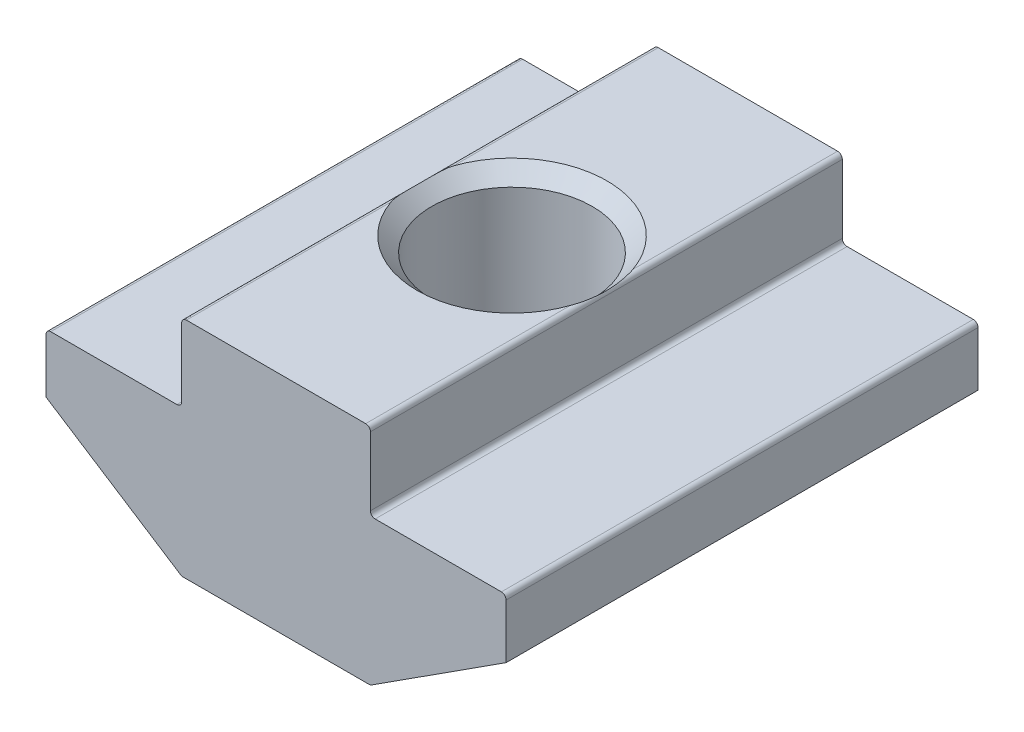
ISO-10303-21;
HEADER;
FILE_DESCRIPTION(('STEP AP214'),'2;1');
FILE_NAME('part.step','',(''),(''),'','','');
FILE_SCHEMA(('AUTOMOTIVE_DESIGN { 1 0 10303 214 1 1 1 1 }'));
ENDSEC;
DATA;
#1=APPLICATION_CONTEXT('core data for automotive mechanical design processes');
#2=APPLICATION_PROTOCOL_DEFINITION('international standard','automotive_design',2000,#1);
#3=PRODUCT_CONTEXT('',#1,'mechanical');
#4=PRODUCT('Part','Part','',(#3));
#5=PRODUCT_RELATED_PRODUCT_CATEGORY('part','',(#4));
#6=PRODUCT_DEFINITION_FORMATION('','',#4);
#7=PRODUCT_DEFINITION_CONTEXT('part definition',#1,'design');
#8=PRODUCT_DEFINITION('design','',#6,#7);
#9=PRODUCT_DEFINITION_SHAPE('','',#8);
#10=(LENGTH_UNIT() NAMED_UNIT(*) SI_UNIT(.MILLI.,.METRE.));
#11=(NAMED_UNIT(*) PLANE_ANGLE_UNIT() SI_UNIT($,.RADIAN.));
#12=(NAMED_UNIT(*) SI_UNIT($,.STERADIAN.) SOLID_ANGLE_UNIT());
#13=UNCERTAINTY_MEASURE_WITH_UNIT(LENGTH_MEASURE(1.E-05),#10,'distance_accuracy_value','');
#14=(GEOMETRIC_REPRESENTATION_CONTEXT(3) GLOBAL_UNCERTAINTY_ASSIGNED_CONTEXT((#13)) GLOBAL_UNIT_ASSIGNED_CONTEXT((#10,
#11,#12)) REPRESENTATION_CONTEXT('',''));
#15=CARTESIAN_POINT('',(0.,0.,0.));
#16=DIRECTION('',(0.,0.,1.));
#17=DIRECTION('',(1.,0.,0.));
#18=AXIS2_PLACEMENT_3D('',#15,#16,#17);
#19=CARTESIAN_POINT('',(-4.,-9.5,10.));
#20=DIRECTION('',(0.,1.,0.));
#21=DIRECTION('',(0.,0.,1.));
#22=AXIS2_PLACEMENT_3D('',#19,#20,#21);
#23=PLANE('',#22);
#24=DIRECTION('',(1.,0.,0.));
#25=VECTOR('',#24,1.);
#26=CARTESIAN_POINT('',(-4.,-9.5,-10.));
#27=LINE('',#26,#25);
#28=CARTESIAN_POINT('',(-3.94121189290537,-9.5,-10.));
#29=VERTEX_POINT('',#28);
#30=CARTESIAN_POINT('',(3.94121189290537,-9.5,-10.));
#31=VERTEX_POINT('',#30);
#32=EDGE_CURVE('E244',#29,#31,#27,.T.);
#33=ORIENTED_EDGE('',*,*,#32,.T.);
#34=DIRECTION('',(0.,0.,-1.));
#35=VECTOR('',#34,1.);
#36=CARTESIAN_POINT('',(3.94121189290537,-9.5,-5.40849535346846));
#37=LINE('',#36,#35);
#38=CARTESIAN_POINT('',(3.94121189290537,-9.5,-0.816990706936917));
#39=VERTEX_POINT('',#38);
#40=EDGE_CURVE('E285',#31,#39,#37,.F.);
#41=ORIENTED_EDGE('',*,*,#40,.T.);
#42=CARTESIAN_POINT('',(0.,-9.5,0.));
#43=DIRECTION('',(0.,1.,0.));
#44=DIRECTION('',(0.,0.,1.));
#45=AXIS2_PLACEMENT_3D('',#42,#43,#44);
#46=CIRCLE('',#45,4.025);
#47=CARTESIAN_POINT('',(-3.94121189290537,-9.5,-0.816990706936917));
#48=VERTEX_POINT('',#47);
#49=EDGE_CURVE('E266',#39,#48,#46,.T.);
#50=ORIENTED_EDGE('',*,*,#49,.T.);
#51=DIRECTION('',(0.,0.,-1.));
#52=VECTOR('',#51,1.);
#53=CARTESIAN_POINT('',(-3.94121189290537,-9.5,-5.40849535346846));
#54=LINE('',#53,#52);
#55=EDGE_CURVE('E283',#48,#29,#54,.T.);
#56=ORIENTED_EDGE('',*,*,#55,.T.);
#57=EDGE_LOOP('',(#33,#41,#50,#56));
#58=FACE_BOUND('',#57,.T.);
#59=ADVANCED_FACE('F37',(#58),#23,.F.);
#60=CARTESIAN_POINT('',(4.,0.,10.));
#61=DIRECTION('',(0.,-1.,0.));
#62=DIRECTION('',(1.,0.,0.));
#63=AXIS2_PLACEMENT_3D('',#60,#61,#62);
#64=PLANE('',#63);
#65=CARTESIAN_POINT('',(0.,0.,0.));
#66=DIRECTION('',(0.,1.,0.));
#67=DIRECTION('',(0.,0.,1.));
#68=AXIS2_PLACEMENT_3D('',#65,#66,#67);
#69=CIRCLE('',#68,4.025);
#70=CARTESIAN_POINT('',(3.8,0.,-1.32688545097156));
#71=VERTEX_POINT('',#70);
#72=CARTESIAN_POINT('',(-3.8,0.,-1.32688545097156));
#73=VERTEX_POINT('',#72);
#74=EDGE_CURVE('E267',#71,#73,#69,.T.);
#75=ORIENTED_EDGE('',*,*,#74,.F.);
#76=DIRECTION('',(0.,0.,-1.));
#77=VECTOR('',#76,1.);
#78=CARTESIAN_POINT('',(3.8,0.,-5.66344272548578));
#79=LINE('',#78,#77);
#80=CARTESIAN_POINT('',(3.8,0.,-10.));
#81=VERTEX_POINT('',#80);
#82=EDGE_CURVE('E482',#71,#81,#79,.T.);
#83=ORIENTED_EDGE('',*,*,#82,.T.);
#84=DIRECTION('',(-1.,0.,0.));
#85=VECTOR('',#84,1.);
#86=CARTESIAN_POINT('',(4.,0.,-10.));
#87=LINE('',#86,#85);
#88=CARTESIAN_POINT('',(-3.8,0.,-10.));
#89=VERTEX_POINT('',#88);
#90=EDGE_CURVE('E258',#81,#89,#87,.T.);
#91=ORIENTED_EDGE('',*,*,#90,.T.);
#92=DIRECTION('',(0.,0.,-1.));
#93=VECTOR('',#92,1.);
#94=CARTESIAN_POINT('',(-3.8,0.,-5.66344272548578));
#95=LINE('',#94,#93);
#96=EDGE_CURVE('E52',#89,#73,#95,.F.);
#97=ORIENTED_EDGE('',*,*,#96,.T.);
#98=EDGE_LOOP('',(#75,#83,#91,#97));
#99=FACE_BOUND('',#98,.T.);
#100=ADVANCED_FACE('F322',(#99),#64,.F.);
#101=DIRECTION('',(-1.,0.,0.));
#102=VECTOR('',#101,1.);
#103=CARTESIAN_POINT('',(4.,0.,10.));
#104=LINE('',#103,#102);
#105=CARTESIAN_POINT('',(3.8,0.,10.));
#106=VERTEX_POINT('',#105);
#107=CARTESIAN_POINT('',(-3.8,0.,10.));
#108=VERTEX_POINT('',#107);
#109=EDGE_CURVE('E231',#106,#108,#104,.T.);
#110=ORIENTED_EDGE('',*,*,#109,.F.);
#111=DIRECTION('',(0.,0.,-1.));
#112=VECTOR('',#111,1.);
#113=CARTESIAN_POINT('',(3.8,0.,10.));
#114=LINE('',#113,#112);
#115=CARTESIAN_POINT('',(3.8,0.,1.32688545097156));
#116=VERTEX_POINT('',#115);
#117=EDGE_CURVE('E416',#106,#116,#114,.T.);
#118=ORIENTED_EDGE('',*,*,#117,.T.);
#119=CARTESIAN_POINT('',(-3.8,0.,1.32688545097156));
#120=VERTEX_POINT('',#119);
#121=EDGE_CURVE('E209',#120,#116,#69,.T.);
#122=ORIENTED_EDGE('',*,*,#121,.F.);
#123=DIRECTION('',(0.,0.,-1.));
#124=VECTOR('',#123,1.);
#125=CARTESIAN_POINT('',(-3.8,0.,10.));
#126=LINE('',#125,#124);
#127=EDGE_CURVE('E414',#120,#108,#126,.F.);
#128=ORIENTED_EDGE('',*,*,#127,.T.);
#129=EDGE_LOOP('',(#110,#118,#122,#128));
#130=FACE_BOUND('',#129,.T.);
#131=ADVANCED_FACE('F325',(#130),#64,.F.);
#132=CARTESIAN_POINT('',(-4.,0.,10.));
#133=DIRECTION('',(1.,0.,0.));
#134=DIRECTION('',(0.,0.,-1.));
#135=AXIS2_PLACEMENT_3D('',#132,#133,#134);
#136=PLANE('',#135);
#137=DIRECTION('',(0.,-1.,0.));
#138=VECTOR('',#137,1.);
#139=CARTESIAN_POINT('',(-4.,0.,10.));
#140=LINE('',#139,#138);
#141=CARTESIAN_POINT('',(-4.,-0.200000000000002,10.));
#142=VERTEX_POINT('',#141);
#143=CARTESIAN_POINT('',(-4.,-3.1,10.));
#144=VERTEX_POINT('',#143);
#145=EDGE_CURVE('E260',#142,#144,#140,.T.);
#146=ORIENTED_EDGE('',*,*,#145,.F.);
#147=DIRECTION('',(0.,0.,-1.));
#148=VECTOR('',#147,1.);
#149=CARTESIAN_POINT('',(-4.,-0.200000000000002,10.));
#150=LINE('',#149,#148);
#151=CARTESIAN_POINT('',(-4.,-0.200000000000002,-10.));
#152=VERTEX_POINT('',#151);
#153=EDGE_CURVE('E463',#142,#152,#150,.T.);
#154=ORIENTED_EDGE('',*,*,#153,.T.);
#155=DIRECTION('',(0.,-1.,0.));
#156=VECTOR('',#155,1.);
#157=CARTESIAN_POINT('',(-4.,0.,-10.));
#158=LINE('',#157,#156);
#159=CARTESIAN_POINT('',(-4.,-3.1,-10.));
#160=VERTEX_POINT('',#159);
#161=EDGE_CURVE('E234',#152,#160,#158,.T.);
#162=ORIENTED_EDGE('',*,*,#161,.T.);
#163=DIRECTION('',(0.,0.,-1.));
#164=VECTOR('',#163,1.);
#165=CARTESIAN_POINT('',(-4.,-3.1,10.));
#166=LINE('',#165,#164);
#167=EDGE_CURVE('E467',#160,#144,#166,.F.);
#168=ORIENTED_EDGE('',*,*,#167,.T.);
#169=EDGE_LOOP('',(#146,#154,#162,#168));
#170=FACE_BOUND('',#169,.T.);
#171=ADVANCED_FACE('F352',(#170),#136,.F.);
#172=CARTESIAN_POINT('',(-4.,-3.3,10.));
#173=DIRECTION('',(0.,-1.,0.));
#174=DIRECTION('',(1.,0.,0.));
#175=AXIS2_PLACEMENT_3D('',#172,#173,#174);
#176=PLANE('',#175);
#177=DIRECTION('',(-1.,0.,0.));
#178=VECTOR('',#177,1.);
#179=CARTESIAN_POINT('',(-4.,-3.3,-10.));
#180=LINE('',#179,#178);
#181=CARTESIAN_POINT('',(-4.2,-3.3,-10.));
#182=VERTEX_POINT('',#181);
#183=CARTESIAN_POINT('',(-9.55,-3.3,-10.));
#184=VERTEX_POINT('',#183);
#185=EDGE_CURVE('E237',#182,#184,#180,.T.);
#186=ORIENTED_EDGE('',*,*,#185,.T.);
#187=DIRECTION('',(0.,0.,-1.));
#188=VECTOR('',#187,1.);
#189=CARTESIAN_POINT('',(-9.55,-3.3,10.));
#190=LINE('',#189,#188);
#191=CARTESIAN_POINT('',(-9.55,-3.3,10.));
#192=VERTEX_POINT('',#191);
#193=EDGE_CURVE('E460',#184,#192,#190,.F.);
#194=ORIENTED_EDGE('',*,*,#193,.T.);
#195=DIRECTION('',(-1.,0.,0.));
#196=VECTOR('',#195,1.);
#197=CARTESIAN_POINT('',(-4.,-3.3,10.));
#198=LINE('',#197,#196);
#199=CARTESIAN_POINT('',(-4.2,-3.3,10.));
#200=VERTEX_POINT('',#199);
#201=EDGE_CURVE('E199',#200,#192,#198,.T.);
#202=ORIENTED_EDGE('',*,*,#201,.F.);
#203=DIRECTION('',(0.,0.,-1.));
#204=VECTOR('',#203,1.);
#205=CARTESIAN_POINT('',(-4.2,-3.3,-10.));
#206=LINE('',#205,#204);
#207=EDGE_CURVE('E462',#200,#182,#206,.T.);
#208=ORIENTED_EDGE('',*,*,#207,.T.);
#209=EDGE_LOOP('',(#186,#194,#202,#208));
#210=FACE_BOUND('',#209,.T.);
#211=ADVANCED_FACE('F349',(#210),#176,.F.);
#212=CARTESIAN_POINT('',(-9.75,-3.3,10.));
#213=DIRECTION('',(1.,0.,0.));
#214=DIRECTION('',(0.,0.,-1.));
#215=AXIS2_PLACEMENT_3D('',#212,#213,#214);
#216=PLANE('',#215);
#217=DIRECTION('',(0.,-1.,0.));
#218=VECTOR('',#217,1.);
#219=CARTESIAN_POINT('',(-9.75,-3.3,10.));
#220=LINE('',#219,#218);
#221=CARTESIAN_POINT('',(-9.75,-3.5,10.));
#222=VERTEX_POINT('',#221);
#223=CARTESIAN_POINT('',(-9.75,-5.8,10.));
#224=VERTEX_POINT('',#223);
#225=EDGE_CURVE('E186',#222,#224,#220,.T.);
#226=ORIENTED_EDGE('',*,*,#225,.F.);
#227=DIRECTION('',(0.,0.,-1.));
#228=VECTOR('',#227,1.);
#229=CARTESIAN_POINT('',(-9.75,-3.5,10.));
#230=LINE('',#229,#228);
#231=CARTESIAN_POINT('',(-9.75,-3.5,-10.));
#232=VERTEX_POINT('',#231);
#233=EDGE_CURVE('E461',#222,#232,#230,.T.);
#234=ORIENTED_EDGE('',*,*,#233,.T.);
#235=DIRECTION('',(0.,-1.,0.));
#236=VECTOR('',#235,1.);
#237=CARTESIAN_POINT('',(-9.75,-3.3,-10.));
#238=LINE('',#237,#236);
#239=CARTESIAN_POINT('',(-9.75,-5.8,-10.));
#240=VERTEX_POINT('',#239);
#241=EDGE_CURVE('E205',#232,#240,#238,.T.);
#242=ORIENTED_EDGE('',*,*,#241,.T.);
#243=DIRECTION('',(0.,0.,-1.));
#244=VECTOR('',#243,1.);
#245=CARTESIAN_POINT('',(-9.75,-5.8,10.));
#246=LINE('',#245,#244);
#247=EDGE_CURVE('E202',#224,#240,#246,.T.);
#248=ORIENTED_EDGE('',*,*,#247,.F.);
#249=EDGE_LOOP('',(#226,#234,#242,#248));
#250=FACE_BOUND('',#249,.T.);
#251=ADVANCED_FACE('F203',(#250),#216,.F.);
#252=CARTESIAN_POINT('',(-9.75,-5.8,10.));
#253=DIRECTION('',(0.541127125407786,0.840940802998586,0.));
#254=DIRECTION('',(-0.840940802998586,0.541127125407786,0.));
#255=AXIS2_PLACEMENT_3D('',#252,#253,#254);
#256=PLANE('',#255);
#257=DIRECTION('',(0.840940802998586,-0.541127125407786,0.));
#258=VECTOR('',#257,1.);
#259=CARTESIAN_POINT('',(-9.75,-5.8,-10.));
#260=LINE('',#259,#258);
#261=CARTESIAN_POINT('',(-4.04943731798692,-9.46818816059972,-10.));
#262=VERTEX_POINT('',#261);
#263=EDGE_CURVE('E242',#240,#262,#260,.T.);
#264=ORIENTED_EDGE('',*,*,#263,.T.);
#265=DIRECTION('',(0.,0.,-1.));
#266=VECTOR('',#265,1.);
#267=CARTESIAN_POINT('',(-4.04943731798692,-9.46818816059972,10.));
#268=LINE('',#267,#266);
#269=CARTESIAN_POINT('',(-4.04943731798692,-9.46818816059972,10.));
#270=VERTEX_POINT('',#269);
#271=EDGE_CURVE('E214',#262,#270,#268,.F.);
#272=ORIENTED_EDGE('',*,*,#271,.T.);
#273=DIRECTION('',(0.840940802998586,-0.541127125407786,0.));
#274=VECTOR('',#273,1.);
#275=CARTESIAN_POINT('',(-9.75,-5.8,10.));
#276=LINE('',#275,#274);
#277=EDGE_CURVE('E191',#224,#270,#276,.T.);
#278=ORIENTED_EDGE('',*,*,#277,.F.);
#279=ORIENTED_EDGE('',*,*,#247,.T.);
#280=EDGE_LOOP('',(#264,#272,#278,#279));
#281=FACE_BOUND('',#280,.T.);
#282=ADVANCED_FACE('F212',(#281),#256,.F.);
#283=CARTESIAN_POINT('',(-3.94121189290537,-9.5,0.816990706936917));
#284=VERTEX_POINT('',#283);
#285=CARTESIAN_POINT('',(3.94121189290537,-9.5,0.816990706936917));
#286=VERTEX_POINT('',#285);
#287=EDGE_CURVE('E263',#284,#286,#46,.T.);
#288=ORIENTED_EDGE('',*,*,#287,.T.);
#289=DIRECTION('',(0.,0.,-1.));
#290=VECTOR('',#289,1.);
#291=CARTESIAN_POINT('',(3.94121189290537,-9.5,10.));
#292=LINE('',#291,#290);
#293=CARTESIAN_POINT('',(3.94121189290537,-9.5,10.));
#294=VERTEX_POINT('',#293);
#295=EDGE_CURVE('E381',#286,#294,#292,.F.);
#296=ORIENTED_EDGE('',*,*,#295,.T.);
#297=DIRECTION('',(1.,0.,0.));
#298=VECTOR('',#297,1.);
#299=CARTESIAN_POINT('',(-4.,-9.5,10.));
#300=LINE('',#299,#298);
#301=CARTESIAN_POINT('',(-3.94121189290537,-9.5,10.));
#302=VERTEX_POINT('',#301);
#303=EDGE_CURVE('E215',#302,#294,#300,.T.);
#304=ORIENTED_EDGE('',*,*,#303,.F.);
#305=DIRECTION('',(0.,0.,-1.));
#306=VECTOR('',#305,1.);
#307=CARTESIAN_POINT('',(-3.94121189290537,-9.5,10.));
#308=LINE('',#307,#306);
#309=EDGE_CURVE('E384',#302,#284,#308,.T.);
#310=ORIENTED_EDGE('',*,*,#309,.T.);
#311=EDGE_LOOP('',(#288,#296,#304,#310));
#312=FACE_BOUND('',#311,.T.);
#313=ADVANCED_FACE('F340',(#312),#23,.F.);
#314=CARTESIAN_POINT('',(9.75,-5.8,10.));
#315=DIRECTION('',(-0.541127125407786,0.840940802998586,0.));
#316=DIRECTION('',(-0.840940802998586,-0.541127125407786,0.));
#317=AXIS2_PLACEMENT_3D('',#314,#315,#316);
#318=PLANE('',#317);
#319=DIRECTION('',(0.840940802998586,0.541127125407786,0.));
#320=VECTOR('',#319,1.);
#321=CARTESIAN_POINT('',(9.75,-5.8,10.));
#322=LINE('',#321,#320);
#323=CARTESIAN_POINT('',(4.04943731798692,-9.46818816059972,10.));
#324=VERTEX_POINT('',#323);
#325=CARTESIAN_POINT('',(9.75,-5.8,10.));
#326=VERTEX_POINT('',#325);
#327=EDGE_CURVE('E217',#324,#326,#322,.T.);
#328=ORIENTED_EDGE('',*,*,#327,.F.);
#329=DIRECTION('',(0.,0.,-1.));
#330=VECTOR('',#329,1.);
#331=CARTESIAN_POINT('',(4.04943731798692,-9.46818816059972,10.));
#332=LINE('',#331,#330);
#333=CARTESIAN_POINT('',(4.04943731798692,-9.46818816059972,-10.));
#334=VERTEX_POINT('',#333);
#335=EDGE_CURVE('E268',#324,#334,#332,.T.);
#336=ORIENTED_EDGE('',*,*,#335,.T.);
#337=DIRECTION('',(0.840940802998586,0.541127125407786,0.));
#338=VECTOR('',#337,1.);
#339=CARTESIAN_POINT('',(9.75,-5.8,-10.));
#340=LINE('',#339,#338);
#341=CARTESIAN_POINT('',(9.75,-5.8,-10.));
#342=VERTEX_POINT('',#341);
#343=EDGE_CURVE('E247',#334,#342,#340,.T.);
#344=ORIENTED_EDGE('',*,*,#343,.T.);
#345=DIRECTION('',(0.,0.,-1.));
#346=VECTOR('',#345,1.);
#347=CARTESIAN_POINT('',(9.75,-5.8,10.));
#348=LINE('',#347,#346);
#349=EDGE_CURVE('E210',#326,#342,#348,.T.);
#350=ORIENTED_EDGE('',*,*,#349,.F.);
#351=EDGE_LOOP('',(#328,#336,#344,#350));
#352=FACE_BOUND('',#351,.T.);
#353=ADVANCED_FACE('F336',(#352),#318,.F.);
#354=CARTESIAN_POINT('',(9.75,-3.3,10.));
#355=DIRECTION('',(-1.,0.,0.));
#356=DIRECTION('',(0.,0.,1.));
#357=AXIS2_PLACEMENT_3D('',#354,#355,#356);
#358=PLANE('',#357);
#359=DIRECTION('',(0.,1.,0.));
#360=VECTOR('',#359,1.);
#361=CARTESIAN_POINT('',(9.75,-3.3,-10.));
#362=LINE('',#361,#360);
#363=CARTESIAN_POINT('',(9.75,-3.5,-10.));
#364=VERTEX_POINT('',#363);
#365=EDGE_CURVE('E249',#342,#364,#362,.T.);
#366=ORIENTED_EDGE('',*,*,#365,.T.);
#367=DIRECTION('',(0.,0.,-1.));
#368=VECTOR('',#367,1.);
#369=CARTESIAN_POINT('',(9.75,-3.5,10.));
#370=LINE('',#369,#368);
#371=CARTESIAN_POINT('',(9.75,-3.5,10.));
#372=VERTEX_POINT('',#371);
#373=EDGE_CURVE('E407',#364,#372,#370,.F.);
#374=ORIENTED_EDGE('',*,*,#373,.T.);
#375=DIRECTION('',(0.,1.,0.));
#376=VECTOR('',#375,1.);
#377=CARTESIAN_POINT('',(9.75,-3.3,10.));
#378=LINE('',#377,#376);
#379=EDGE_CURVE('E222',#326,#372,#378,.T.);
#380=ORIENTED_EDGE('',*,*,#379,.F.);
#381=ORIENTED_EDGE('',*,*,#349,.T.);
#382=EDGE_LOOP('',(#366,#374,#380,#381));
#383=FACE_BOUND('',#382,.T.);
#384=ADVANCED_FACE('F332',(#383),#358,.F.);
#385=CARTESIAN_POINT('',(4.,-3.3,10.));
#386=DIRECTION('',(0.,-1.,0.));
#387=DIRECTION('',(1.,0.,0.));
#388=AXIS2_PLACEMENT_3D('',#385,#386,#387);
#389=PLANE('',#388);
#390=DIRECTION('',(-1.,0.,0.));
#391=VECTOR('',#390,1.);
#392=CARTESIAN_POINT('',(4.,-3.3,10.));
#393=LINE('',#392,#391);
#394=CARTESIAN_POINT('',(9.55,-3.3,10.));
#395=VERTEX_POINT('',#394);
#396=CARTESIAN_POINT('',(4.2,-3.3,10.));
#397=VERTEX_POINT('',#396);
#398=EDGE_CURVE('E225',#395,#397,#393,.T.);
#399=ORIENTED_EDGE('',*,*,#398,.F.);
#400=DIRECTION('',(0.,0.,-1.));
#401=VECTOR('',#400,1.);
#402=CARTESIAN_POINT('',(9.55,-3.3,10.));
#403=LINE('',#402,#401);
#404=CARTESIAN_POINT('',(9.55,-3.3,-10.));
#405=VERTEX_POINT('',#404);
#406=EDGE_CURVE('E404',#395,#405,#403,.T.);
#407=ORIENTED_EDGE('',*,*,#406,.T.);
#408=DIRECTION('',(-1.,0.,0.));
#409=VECTOR('',#408,1.);
#410=CARTESIAN_POINT('',(4.,-3.3,-10.));
#411=LINE('',#410,#409);
#412=CARTESIAN_POINT('',(4.2,-3.3,-10.));
#413=VERTEX_POINT('',#412);
#414=EDGE_CURVE('E252',#405,#413,#411,.T.);
#415=ORIENTED_EDGE('',*,*,#414,.T.);
#416=DIRECTION('',(0.,0.,-1.));
#417=VECTOR('',#416,1.);
#418=CARTESIAN_POINT('',(4.2,-3.3,10.));
#419=LINE('',#418,#417);
#420=EDGE_CURVE('E402',#413,#397,#419,.F.);
#421=ORIENTED_EDGE('',*,*,#420,.T.);
#422=EDGE_LOOP('',(#399,#407,#415,#421));
#423=FACE_BOUND('',#422,.T.);
#424=ADVANCED_FACE('F328',(#423),#389,.F.);
#425=CARTESIAN_POINT('',(4.,0.,10.));
#426=DIRECTION('',(-1.,0.,0.));
#427=DIRECTION('',(0.,0.,1.));
#428=AXIS2_PLACEMENT_3D('',#425,#426,#427);
#429=PLANE('',#428);
#430=DIRECTION('',(0.,1.,0.));
#431=VECTOR('',#430,1.);
#432=CARTESIAN_POINT('',(4.,0.,10.));
#433=LINE('',#432,#431);
#434=CARTESIAN_POINT('',(4.,-3.1,10.));
#435=VERTEX_POINT('',#434);
#436=CARTESIAN_POINT('',(4.,-0.199999999999998,10.));
#437=VERTEX_POINT('',#436);
#438=EDGE_CURVE('E228',#435,#437,#433,.T.);
#439=ORIENTED_EDGE('',*,*,#438,.F.);
#440=DIRECTION('',(0.,0.,-1.));
#441=VECTOR('',#440,1.);
#442=CARTESIAN_POINT('',(4.,-3.1,-10.));
#443=LINE('',#442,#441);
#444=CARTESIAN_POINT('',(4.,-3.1,-10.));
#445=VERTEX_POINT('',#444);
#446=EDGE_CURVE('E411',#435,#445,#443,.T.);
#447=ORIENTED_EDGE('',*,*,#446,.T.);
#448=DIRECTION('',(0.,1.,0.));
#449=VECTOR('',#448,1.);
#450=CARTESIAN_POINT('',(4.,0.,-10.));
#451=LINE('',#450,#449);
#452=CARTESIAN_POINT('',(4.,-0.199999999999998,-10.));
#453=VERTEX_POINT('',#452);
#454=EDGE_CURVE('E255',#445,#453,#451,.T.);
#455=ORIENTED_EDGE('',*,*,#454,.T.);
#456=DIRECTION('',(0.,0.,-1.));
#457=VECTOR('',#456,1.);
#458=CARTESIAN_POINT('',(4.,-0.199999999999998,10.));
#459=LINE('',#458,#457);
#460=EDGE_CURVE('E409',#453,#437,#459,.F.);
#461=ORIENTED_EDGE('',*,*,#460,.T.);
#462=EDGE_LOOP('',(#439,#447,#455,#461));
#463=FACE_BOUND('',#462,.T.);
#464=ADVANCED_FACE('F318',(#463),#429,.F.);
#465=CARTESIAN_POINT('',(0.,0.,10.));
#466=DIRECTION('',(0.,0.,-1.));
#467=DIRECTION('',(-1.,0.,0.));
#468=AXIS2_PLACEMENT_3D('',#465,#466,#467);
#469=PLANE('',#468);
#470=ORIENTED_EDGE('',*,*,#303,.T.);
#471=CARTESIAN_POINT('',(3.94121189290537,-9.3,10.));
#472=DIRECTION('',(0.,0.,-1.));
#473=DIRECTION('',(-1.,0.,0.));
#474=AXIS2_PLACEMENT_3D('',#471,#472,#473);
#475=CIRCLE('',#474,0.2);
#476=EDGE_CURVE('E399',#294,#324,#475,.F.);
#477=ORIENTED_EDGE('',*,*,#476,.T.);
#478=ORIENTED_EDGE('',*,*,#327,.T.);
#479=ORIENTED_EDGE('',*,*,#379,.T.);
#480=CARTESIAN_POINT('',(9.55,-3.5,10.));
#481=DIRECTION('',(0.,0.,-1.));
#482=DIRECTION('',(-1.,0.,0.));
#483=AXIS2_PLACEMENT_3D('',#480,#481,#482);
#484=CIRCLE('',#483,0.2);
#485=EDGE_CURVE('E395',#372,#395,#484,.F.);
#486=ORIENTED_EDGE('',*,*,#485,.T.);
#487=ORIENTED_EDGE('',*,*,#398,.T.);
#488=CARTESIAN_POINT('',(4.2,-3.1,10.));
#489=DIRECTION('',(0.,0.,-1.));
#490=DIRECTION('',(-1.,0.,0.));
#491=AXIS2_PLACEMENT_3D('',#488,#489,#490);
#492=CIRCLE('',#491,0.2);
#493=EDGE_CURVE('E474',#397,#435,#492,.T.);
#494=ORIENTED_EDGE('',*,*,#493,.T.);
#495=ORIENTED_EDGE('',*,*,#438,.T.);
#496=CARTESIAN_POINT('',(3.8,-0.199999999999998,10.));
#497=DIRECTION('',(0.,0.,-1.));
#498=DIRECTION('',(-1.,0.,0.));
#499=AXIS2_PLACEMENT_3D('',#496,#497,#498);
#500=CIRCLE('',#499,0.2);
#501=EDGE_CURVE('E393',#437,#106,#500,.F.);
#502=ORIENTED_EDGE('',*,*,#501,.T.);
#503=ORIENTED_EDGE('',*,*,#109,.T.);
#504=CARTESIAN_POINT('',(-3.8,-0.200000000000002,10.));
#505=DIRECTION('',(0.,0.,-1.));
#506=DIRECTION('',(-1.,0.,0.));
#507=AXIS2_PLACEMENT_3D('',#504,#505,#506);
#508=CIRCLE('',#507,0.2);
#509=EDGE_CURVE('E391',#108,#142,#508,.F.);
#510=ORIENTED_EDGE('',*,*,#509,.T.);
#511=ORIENTED_EDGE('',*,*,#145,.T.);
#512=CARTESIAN_POINT('',(-4.2,-3.1,10.));
#513=DIRECTION('',(0.,0.,-1.));
#514=DIRECTION('',(-1.,0.,0.));
#515=AXIS2_PLACEMENT_3D('',#512,#513,#514);
#516=CIRCLE('',#515,0.2);
#517=EDGE_CURVE('E11',#144,#200,#516,.T.);
#518=ORIENTED_EDGE('',*,*,#517,.T.);
#519=ORIENTED_EDGE('',*,*,#201,.T.);
#520=CARTESIAN_POINT('',(-9.55,-3.5,10.));
#521=DIRECTION('',(0.,0.,-1.));
#522=DIRECTION('',(-1.,0.,0.));
#523=AXIS2_PLACEMENT_3D('',#520,#521,#522);
#524=CIRCLE('',#523,0.2);
#525=EDGE_CURVE('E195',#192,#222,#524,.F.);
#526=ORIENTED_EDGE('',*,*,#525,.T.);
#527=ORIENTED_EDGE('',*,*,#225,.T.);
#528=ORIENTED_EDGE('',*,*,#277,.T.);
#529=CARTESIAN_POINT('',(-3.94121189290537,-9.3,10.));
#530=DIRECTION('',(0.,0.,-1.));
#531=DIRECTION('',(-1.,0.,0.));
#532=AXIS2_PLACEMENT_3D('',#529,#530,#531);
#533=CIRCLE('',#532,0.2);
#534=EDGE_CURVE('E397',#270,#302,#533,.F.);
#535=ORIENTED_EDGE('',*,*,#534,.T.);
#536=EDGE_LOOP('',(#470,#477,#478,#479,#486,#487,#494,#495,#502,#503,#510,#511,#518,#519,#526,
#527,#528,#535));
#537=FACE_BOUND('',#536,.T.);
#538=ADVANCED_FACE('F189',(#537),#469,.F.);
#539=CARTESIAN_POINT('',(0.,0.,-10.));
#540=DIRECTION('',(0.,0.,-1.));
#541=DIRECTION('',(-1.,0.,0.));
#542=AXIS2_PLACEMENT_3D('',#539,#540,#541);
#543=PLANE('',#542);
#544=ORIENTED_EDGE('',*,*,#343,.F.);
#545=CARTESIAN_POINT('',(3.94121189290537,-9.3,-10.));
#546=DIRECTION('',(0.,0.,-1.));
#547=DIRECTION('',(-1.,0.,0.));
#548=AXIS2_PLACEMENT_3D('',#545,#546,#547);
#549=CIRCLE('',#548,0.2);
#550=EDGE_CURVE('E281',#334,#31,#549,.T.);
#551=ORIENTED_EDGE('',*,*,#550,.T.);
#552=ORIENTED_EDGE('',*,*,#32,.F.);
#553=CARTESIAN_POINT('',(-3.94121189290537,-9.3,-10.));
#554=DIRECTION('',(0.,0.,-1.));
#555=DIRECTION('',(-1.,0.,0.));
#556=AXIS2_PLACEMENT_3D('',#553,#554,#555);
#557=CIRCLE('',#556,0.2);
#558=EDGE_CURVE('E279',#29,#262,#557,.T.);
#559=ORIENTED_EDGE('',*,*,#558,.T.);
#560=ORIENTED_EDGE('',*,*,#263,.F.);
#561=ORIENTED_EDGE('',*,*,#241,.F.);
#562=CARTESIAN_POINT('',(-9.55,-3.5,-10.));
#563=DIRECTION('',(0.,0.,-1.));
#564=DIRECTION('',(-1.,0.,0.));
#565=AXIS2_PLACEMENT_3D('',#562,#563,#564);
#566=CIRCLE('',#565,0.2);
#567=EDGE_CURVE('E271',#232,#184,#566,.T.);
#568=ORIENTED_EDGE('',*,*,#567,.T.);
#569=ORIENTED_EDGE('',*,*,#185,.F.);
#570=CARTESIAN_POINT('',(-4.2,-3.1,-10.));
#571=DIRECTION('',(0.,0.,-1.));
#572=DIRECTION('',(-1.,0.,0.));
#573=AXIS2_PLACEMENT_3D('',#570,#571,#572);
#574=CIRCLE('',#573,0.2);
#575=EDGE_CURVE('E45',#182,#160,#574,.F.);
#576=ORIENTED_EDGE('',*,*,#575,.T.);
#577=ORIENTED_EDGE('',*,*,#161,.F.);
#578=CARTESIAN_POINT('',(-3.8,-0.200000000000002,-10.));
#579=DIRECTION('',(0.,0.,-1.));
#580=DIRECTION('',(-1.,0.,0.));
#581=AXIS2_PLACEMENT_3D('',#578,#579,#580);
#582=CIRCLE('',#581,0.2);
#583=EDGE_CURVE('E273',#152,#89,#582,.T.);
#584=ORIENTED_EDGE('',*,*,#583,.T.);
#585=ORIENTED_EDGE('',*,*,#90,.F.);
#586=CARTESIAN_POINT('',(3.8,-0.199999999999998,-10.));
#587=DIRECTION('',(0.,0.,-1.));
#588=DIRECTION('',(-1.,0.,0.));
#589=AXIS2_PLACEMENT_3D('',#586,#587,#588);
#590=CIRCLE('',#589,0.2);
#591=EDGE_CURVE('E275',#81,#453,#590,.T.);
#592=ORIENTED_EDGE('',*,*,#591,.T.);
#593=ORIENTED_EDGE('',*,*,#454,.F.);
#594=CARTESIAN_POINT('',(4.2,-3.1,-10.));
#595=DIRECTION('',(0.,0.,-1.));
#596=DIRECTION('',(-1.,0.,0.));
#597=AXIS2_PLACEMENT_3D('',#594,#595,#596);
#598=CIRCLE('',#597,0.2);
#599=EDGE_CURVE('E472',#445,#413,#598,.F.);
#600=ORIENTED_EDGE('',*,*,#599,.T.);
#601=ORIENTED_EDGE('',*,*,#414,.F.);
#602=CARTESIAN_POINT('',(9.55,-3.5,-10.));
#603=DIRECTION('',(0.,0.,-1.));
#604=DIRECTION('',(-1.,0.,0.));
#605=AXIS2_PLACEMENT_3D('',#602,#603,#604);
#606=CIRCLE('',#605,0.2);
#607=EDGE_CURVE('E277',#405,#364,#606,.T.);
#608=ORIENTED_EDGE('',*,*,#607,.T.);
#609=ORIENTED_EDGE('',*,*,#365,.F.);
#610=EDGE_LOOP('',(#544,#551,#552,#559,#560,#561,#568,#569,#576,#577,#584,#585,#592,#593,#600,
#601,#608,#609));
#611=FACE_BOUND('',#610,.T.);
#612=ADVANCED_FACE('F311',(#611),#543,.T.);
#613=CARTESIAN_POINT('',(0.,-8.875,0.));
#614=DIRECTION('',(0.,-1.,0.));
#615=DIRECTION('',(0.,0.,-1.));
#616=AXIS2_PLACEMENT_3D('',#613,#614,#615);
#617=CONICAL_SURFACE('',#616,3.4,0.785398163397446);
#618=CARTESIAN_POINT('',(0.,-8.875,0.));
#619=DIRECTION('',(0.,1.,0.));
#620=DIRECTION('',(0.,0.,1.));
#621=AXIS2_PLACEMENT_3D('',#618,#619,#620);
#622=CIRCLE('',#621,3.4);
#623=CARTESIAN_POINT('',(0.,-8.875,3.4));
#624=VERTEX_POINT('',#623);
#625=EDGE_CURVE('E238',#624,#624,#622,.T.);
#626=ORIENTED_EDGE('',*,*,#625,.T.);
#627=EDGE_LOOP('',(#626));
#628=FACE_BOUND('',#627,.T.);
#629=ORIENTED_EDGE('',*,*,#49,.F.);
#630=CARTESIAN_POINT('',(3.94121189290537,-9.5,-0.816990706936917));
#631=CARTESIAN_POINT('',(3.94799315958019,-9.49997529024304,-0.784155957234443));
#632=CARTESIAN_POINT('',(3.95407291890728,-9.49965585960148,-0.751189326134507));
#633=CARTESIAN_POINT('',(3.96504688647184,-9.49865733218584,-0.685085975463539));
#634=CARTESIAN_POINT('',(3.96994189767912,-9.49797848001203,-0.651949386724581));
#635=CARTESIAN_POINT('',(3.97875477199452,-9.49649320715703,-0.585687876681422));
#636=CARTESIAN_POINT('',(3.98267646875448,-9.49568730809073,-0.552563439806455));
#637=CARTESIAN_POINT('',(3.98968983194709,-9.49406946879795,-0.486216902261393));
#638=CARTESIAN_POINT('',(3.99278123228459,-9.49325752672027,-0.452994773723124));
#639=CARTESIAN_POINT('',(3.99969521438382,-9.49130831244064,-0.368523994839412));
#640=CARTESIAN_POINT('',(4.0030106632455,-9.49023223397175,-0.317232146179199));
#641=CARTESIAN_POINT('',(4.0080941881248,-9.48850406501014,-0.214562568883289));
#642=CARTESIAN_POINT('',(4.00986213805264,-9.48785200906777,-0.163184833591227));
#643=CARTESIAN_POINT('',(4.01195049822804,-9.48707564844284,-0.0603905154489922));
#644=CARTESIAN_POINT('',(4.01227075358612,-9.48695140023077,-0.00897392903069043));
#645=CARTESIAN_POINT('',(4.01148129263369,-9.487249512556,0.0938467135470104));
#646=CARTESIAN_POINT('',(4.01037157423666,-9.48767187389089,0.145250769688017));
#647=CARTESIAN_POINT('',(4.00663658211229,-9.48900710097656,0.248647701907112));
#648=CARTESIAN_POINT('',(4.00399237147493,-9.48992608554227,0.300639828083516));
#649=CARTESIAN_POINT('',(3.99701422206641,-9.49209239266836,0.404494431783524));
#650=CARTESIAN_POINT('',(3.99268061482003,-9.4933396507932,0.456356932736217));
#651=CARTESIAN_POINT('',(3.98203490946775,-9.49586753729662,0.559893292201917));
#652=CARTESIAN_POINT('',(3.97572252447845,-9.49714817048922,0.611567122261746));
#653=CARTESIAN_POINT('',(3.96437609854169,-9.49869054807694,0.688829218203936));
#654=CARTESIAN_POINT('',(3.96027922666915,-9.49914166971568,0.714550727794099));
#655=CARTESIAN_POINT('',(3.95133714029243,-9.49979164893942,0.765872870461265));
#656=CARTESIAN_POINT('',(3.94649172393116,-9.49999043834531,0.791473469007862));
#657=CARTESIAN_POINT('',(3.94121189290537,-9.5,0.816990706936916));
#658=B_SPLINE_CURVE_WITH_KNOTS('',3,(#630,#631,#632,#633,#634,#635,#636,#637,#638,#639,#640,
#641,#642,#643,#644,#645,#646,#647,#648,#649,#650,#651,#652,#653,#654,#655,#656,#657),
.UNSPECIFIED.,.F.,.F.,(4,2,2,2,2,2,2,2,2,2,2,2,2,4),(0.,0.100556341246077,0.201044337802015,
0.301130020301242,0.401247740300502,0.555448933706927,0.709662690214816,0.863892945731546,
1.01812342629004,1.17429898295766,1.33044390737061,1.48661148016858,1.56474973924464,
1.64290910646335),.UNSPECIFIED.);
#659=EDGE_CURVE('E295',#39,#286,#658,.T.);
#660=ORIENTED_EDGE('',*,*,#659,.T.);
#661=ORIENTED_EDGE('',*,*,#287,.F.);
#662=CARTESIAN_POINT('',(-3.94121189290537,-9.5,0.816990706936917));
#663=CARTESIAN_POINT('',(-3.94799315958019,-9.49997529024304,0.784155957234443));
#664=CARTESIAN_POINT('',(-3.95407291890728,-9.49965585960148,0.751189326134507));
#665=CARTESIAN_POINT('',(-3.96504688647184,-9.49865733218584,0.685085975463539));
#666=CARTESIAN_POINT('',(-3.96994189767912,-9.49797848001203,0.651949386724581));
#667=CARTESIAN_POINT('',(-3.97875477199452,-9.49649320715703,0.585687876681422));
#668=CARTESIAN_POINT('',(-3.98267646875448,-9.49568730809073,0.552563439806455));
#669=CARTESIAN_POINT('',(-3.98968983194709,-9.49406946879795,0.486216902261393));
#670=CARTESIAN_POINT('',(-3.99278123228459,-9.49325752672027,0.452994773723124));
#671=CARTESIAN_POINT('',(-3.99969521438382,-9.49130831244064,0.368523994839412));
#672=CARTESIAN_POINT('',(-4.0030106632455,-9.49023223397175,0.317232146179199));
#673=CARTESIAN_POINT('',(-4.0080941881248,-9.48850406501014,0.214562568883289));
#674=CARTESIAN_POINT('',(-4.00986213805264,-9.48785200906777,0.163184833591227));
#675=CARTESIAN_POINT('',(-4.01195049822804,-9.48707564844284,0.0603905154489922));
#676=CARTESIAN_POINT('',(-4.01227075358612,-9.48695140023077,0.00897392903069043));
#677=CARTESIAN_POINT('',(-4.01148129263369,-9.487249512556,-0.0938467135470104));
#678=CARTESIAN_POINT('',(-4.01037157423666,-9.48767187389089,-0.145250769688017));
#679=CARTESIAN_POINT('',(-4.00663658211229,-9.48900710097656,-0.248647701907112));
#680=CARTESIAN_POINT('',(-4.00399237147493,-9.48992608554227,-0.300639828083516));
#681=CARTESIAN_POINT('',(-3.99701422206641,-9.49209239266836,-0.404494431783524));
#682=CARTESIAN_POINT('',(-3.99268061482003,-9.4933396507932,-0.456356932736217));
#683=CARTESIAN_POINT('',(-3.98203490946775,-9.49586753729662,-0.559893292201917));
#684=CARTESIAN_POINT('',(-3.97572252447845,-9.49714817048922,-0.611567122261746));
#685=CARTESIAN_POINT('',(-3.96437609854169,-9.49869054807694,-0.688829218203936));
#686=CARTESIAN_POINT('',(-3.96027922666915,-9.49914166971568,-0.714550727794099));
#687=CARTESIAN_POINT('',(-3.95133714029243,-9.49979164893942,-0.765872870461265));
#688=CARTESIAN_POINT('',(-3.94649172393116,-9.49999043834531,-0.791473469007862));
#689=CARTESIAN_POINT('',(-3.94121189290537,-9.5,-0.816990706936916));
#690=B_SPLINE_CURVE_WITH_KNOTS('',3,(#662,#663,#664,#665,#666,#667,#668,#669,#670,#671,#672,
#673,#674,#675,#676,#677,#678,#679,#680,#681,#682,#683,#684,#685,#686,#687,#688,#689),
.UNSPECIFIED.,.F.,.F.,(4,2,2,2,2,2,2,2,2,2,2,2,2,4),(0.,0.100556341246077,0.201044337802015,
0.301130020301242,0.401247740300502,0.555448933706927,0.709662690214816,0.863892945731546,
1.01812342629004,1.17429898295766,1.33044390737061,1.48661148016858,1.56474973924464,
1.64290910646335),.UNSPECIFIED.);
#691=EDGE_CURVE('E287',#284,#48,#690,.T.);
#692=ORIENTED_EDGE('',*,*,#691,.T.);
#693=EDGE_LOOP('',(#629,#660,#661,#692));
#694=FACE_BOUND('',#693,.T.);
#695=ADVANCED_FACE('F305',(#628,#694),#617,.F.);
#696=CARTESIAN_POINT('',(0.,0.,0.));
#697=DIRECTION('',(0.,1.,0.));
#698=DIRECTION('',(0.,0.,1.));
#699=AXIS2_PLACEMENT_3D('',#696,#697,#698);
#700=CONICAL_SURFACE('',#699,4.025,0.78539816339745);
#701=CARTESIAN_POINT('',(0.,-0.625,0.));
#702=DIRECTION('',(0.,1.,0.));
#703=DIRECTION('',(0.,0.,1.));
#704=AXIS2_PLACEMENT_3D('',#701,#702,#703);
#705=CIRCLE('',#704,3.4);
#706=CARTESIAN_POINT('',(0.,-0.625,3.4));
#707=VERTEX_POINT('',#706);
#708=EDGE_CURVE('E442',#707,#707,#705,.T.);
#709=ORIENTED_EDGE('',*,*,#708,.F.);
#710=EDGE_LOOP('',(#709));
#711=FACE_BOUND('',#710,.T.);
#712=ORIENTED_EDGE('',*,*,#121,.T.);
#713=CARTESIAN_POINT('',(3.8,0.,1.32688545097156));
#714=CARTESIAN_POINT('',(3.80554334315574,-6.7790114932195E-06,1.31098976556139));
#715=CARTESIAN_POINT('',(3.81078036332907,-0.000229992919810445,1.29499409804526));
#716=CARTESIAN_POINT('',(3.82072677703355,-0.00101281336398038,1.26285482833395));
#717=CARTESIAN_POINT('',(3.82543641031592,-0.00157226630229545,1.24671129699843));
#718=CARTESIAN_POINT('',(3.83889403255457,-0.00360854428851487,1.19816804677963));
#719=CARTESIAN_POINT('',(3.84698832918909,-0.00544394302282992,1.16560330407693));
#720=CARTESIAN_POINT('',(3.86183672779947,-0.00964423998982071,1.10019107061229));
#721=CARTESIAN_POINT('',(3.86858997872028,-0.012009472452788,1.06734341401422));
#722=CARTESIAN_POINT('',(3.8810007918504,-0.0170153232657248,1.00144514856063));
#723=CARTESIAN_POINT('',(3.88665771160289,-0.0196561017014153,0.968394432343408));
#724=CARTESIAN_POINT('',(3.90229637976872,-0.0277354942487117,0.86874274673655));
#725=CARTESIAN_POINT('',(3.91088350213293,-0.0333088924713883,0.80193402477748));
#726=CARTESIAN_POINT('',(3.92528548858618,-0.0438533651216328,0.667962983939942));
#727=CARTESIAN_POINT('',(3.93109944711384,-0.0488242424046177,0.600800556789429));
#728=CARTESIAN_POINT('',(3.94053557799145,-0.0575528476162477,0.46620786295021));
#729=CARTESIAN_POINT('',(3.94415659053201,-0.061309933103215,0.398777473483137));
#730=CARTESIAN_POINT('',(3.94958922604394,-0.0671879576587513,0.263772637822497));
#731=CARTESIAN_POINT('',(3.9514008351774,-0.0693088842143271,0.19619819053117));
#732=CARTESIAN_POINT('',(3.95342344015976,-0.0716888736724997,0.060842006622173));
#733=CARTESIAN_POINT('',(3.95363087168871,-0.071943790423476,-0.00693985702674956));
#734=CARTESIAN_POINT('',(3.95246068942752,-0.0705528962542461,-0.142475261007635));
#735=CARTESIAN_POINT('',(3.95108295944444,-0.0689069459997509,-0.210228798899122));
#736=CARTESIAN_POINT('',(3.9465816753063,-0.0638931938684798,-0.345601159107514));
#737=CARTESIAN_POINT('',(3.94345843749601,-0.0605257040020503,-0.413220003607536));
#738=CARTESIAN_POINT('',(3.9351280942038,-0.0524385067770695,-0.548243142785727));
#739=CARTESIAN_POINT('',(3.92992123212755,-0.0477189573822475,-0.615647461597725));
#740=CARTESIAN_POINT('',(3.91811394970785,-0.0384639655311078,-0.737455493710977));
#741=CARTESIAN_POINT('',(3.9119617675583,-0.0340617722581236,-0.791912792685345));
#742=CARTESIAN_POINT('',(3.89751998642992,-0.0251782053488177,-0.900493917439085));
#743=CARTESIAN_POINT('',(3.88923246393308,-0.0206969125533273,-0.95461801517281));
#744=CARTESIAN_POINT('',(3.87473062290608,-0.0144128649125473,-1.03538019073641));
#745=CARTESIAN_POINT('',(3.86956122609736,-0.0123939667002255,-1.06218887379597));
#746=CARTESIAN_POINT('',(3.85840782176166,-0.00862856315843852,-1.11564803730433));
#747=CARTESIAN_POINT('',(3.8524240638286,-0.00688197471917855,-1.14229856362496));
#748=CARTESIAN_POINT('',(3.8394685026799,-0.00381638905068052,-1.19546950596921));
#749=CARTESIAN_POINT('',(3.83249400184403,-0.00249859269477719,-1.22198935516551));
#750=CARTESIAN_POINT('',(3.81727316766838,-0.000609456547705012,-1.27471493677779));
#751=CARTESIAN_POINT('',(3.80902549030776,-3.89116954754593E-05,-1.30092030533757));
#752=CARTESIAN_POINT('',(3.80000000000001,0.,-1.32688545097156));
#753=B_SPLINE_CURVE_WITH_KNOTS('',3,(#713,#714,#715,#716,#717,#718,#719,#720,#721,#722,#723,
#724,#725,#726,#727,#728,#729,#730,#731,#732,#733,#734,#735,#736,#737,#738,#739,#740,#741,#742,
#743,#744,#745,#746,#747,#748,#749,#750,#751,#752),.UNSPECIFIED.,.F.,.F.,(4,2,2,2,2,2,2,2,2,2,2,
2,2,2,2,2,2,2,2,4),(0.,0.0504896548246094,0.100956262953731,0.201724075449144,0.302555634313373,
0.403446103603135,0.606123326217642,0.808866686731115,1.01171718110569,1.21456922682203,
1.41787186007665,1.62118939643907,1.82447009676439,2.02772705709118,2.19263733201078,
2.35738784352253,2.43950797423825,2.52160299236186,2.60392598522083,2.6863364837451),.UNSPECIFIED.);
#754=EDGE_CURVE('E59',#116,#71,#753,.T.);
#755=ORIENTED_EDGE('',*,*,#754,.T.);
#756=ORIENTED_EDGE('',*,*,#74,.T.);
#757=CARTESIAN_POINT('',(-3.8,0.,-1.32688545097156));
#758=CARTESIAN_POINT('',(-3.80554334315574,-6.77901149693197E-06,-1.31098976556139));
#759=CARTESIAN_POINT('',(-3.81078036332907,-0.000229992919814648,-1.29499409804526));
#760=CARTESIAN_POINT('',(-3.82072677703354,-0.00101281336398487,-1.26285482833395));
#761=CARTESIAN_POINT('',(-3.82543641031592,-0.00157226630229975,-1.24671129699842));
#762=CARTESIAN_POINT('',(-3.83889403255457,-0.00360854428851875,-1.19816804677963));
#763=CARTESIAN_POINT('',(-3.84698832918909,-0.00544394302283375,-1.16560330407693));
#764=CARTESIAN_POINT('',(-3.86183672779947,-0.00964423998982438,-1.10019107061229));
#765=CARTESIAN_POINT('',(-3.86858997872027,-0.0120094724527916,-1.06734341401422));
#766=CARTESIAN_POINT('',(-3.88100079185039,-0.0170153232657282,-1.00144514856063));
#767=CARTESIAN_POINT('',(-3.88665771160289,-0.0196561017014186,-0.968394432343407));
#768=CARTESIAN_POINT('',(-3.90229637976871,-0.0277354942487148,-0.868742746736549));
#769=CARTESIAN_POINT('',(-3.91088350213292,-0.0333088924713912,-0.801934024777479));
#770=CARTESIAN_POINT('',(-3.92528548858618,-0.0438533651216354,-0.667962983939941));
#771=CARTESIAN_POINT('',(-3.93109944711384,-0.0488242424046202,-0.600800556789428));
#772=CARTESIAN_POINT('',(-3.94053557799145,-0.0575528476162501,-0.466207862950209));
#773=CARTESIAN_POINT('',(-3.94415659053201,-0.0613099331032174,-0.398777473483136));
#774=CARTESIAN_POINT('',(-3.94958922604393,-0.0671879576587535,-0.263772637822496));
#775=CARTESIAN_POINT('',(-3.9514008351774,-0.0693088842143292,-0.196198190531169));
#776=CARTESIAN_POINT('',(-3.95342344015975,-0.0716888736725019,-0.060842006622172));
#777=CARTESIAN_POINT('',(-3.95363087168871,-0.0719437904234782,0.00693985702675052));
#778=CARTESIAN_POINT('',(-3.95246068942751,-0.0705528962542481,0.142475261007636));
#779=CARTESIAN_POINT('',(-3.95108295944444,-0.0689069459997526,0.210228798899123));
#780=CARTESIAN_POINT('',(-3.9465816753063,-0.0638931938684816,0.345601159107515));
#781=CARTESIAN_POINT('',(-3.943458437496,-0.0605257040020525,0.413220003607537));
#782=CARTESIAN_POINT('',(-3.9351280942038,-0.0524385067770721,0.548243142785728));
#783=CARTESIAN_POINT('',(-3.92992123212755,-0.04771895738225,0.615647461597726));
#784=CARTESIAN_POINT('',(-3.91811394970784,-0.0384639655311105,0.737455493710978));
#785=CARTESIAN_POINT('',(-3.91196176755829,-0.0340617722581265,0.791912792685346));
#786=CARTESIAN_POINT('',(-3.89751998642992,-0.0251782053488207,0.900493917439086));
#787=CARTESIAN_POINT('',(-3.88923246393308,-0.0206969125533302,0.95461801517281));
#788=CARTESIAN_POINT('',(-3.87473062290608,-0.0144128649125506,1.03538019073641));
#789=CARTESIAN_POINT('',(-3.86956122609736,-0.0123939667002289,1.06218887379597));
#790=CARTESIAN_POINT('',(-3.85840782176166,-0.00862856315844211,1.11564803730434));
#791=CARTESIAN_POINT('',(-3.8524240638286,-0.0068819747191821,1.14229856362496));
#792=CARTESIAN_POINT('',(-3.83946850267989,-0.00381638905068424,1.19546950596921));
#793=CARTESIAN_POINT('',(-3.83249400184402,-0.00249859269478113,1.22198935516551));
#794=CARTESIAN_POINT('',(-3.81727316766838,-0.000609456547709386,1.27471493677779));
#795=CARTESIAN_POINT('',(-3.80902549030775,-3.89116954800619E-05,1.30092030533757));
#796=CARTESIAN_POINT('',(-3.8,0.,1.32688545097156));
#797=B_SPLINE_CURVE_WITH_KNOTS('',3,(#757,#758,#759,#760,#761,#762,#763,#764,#765,#766,#767,
#768,#769,#770,#771,#772,#773,#774,#775,#776,#777,#778,#779,#780,#781,#782,#783,#784,#785,#786,
#787,#788,#789,#790,#791,#792,#793,#794,#795,#796),.UNSPECIFIED.,.F.,.F.,(4,2,2,2,2,2,2,2,2,2,2,
2,2,2,2,2,2,2,2,4),(0.,0.0504896548246094,0.100956262953731,0.201724075449143,0.302555634313373,
0.403446103603135,0.606123326217642,0.808866686731115,1.01171718110569,1.21456922682203,
1.41787186007665,1.62118939643907,1.82447009676439,2.02772705709118,2.19263733201078,
2.35738784352253,2.43950797423825,2.52160299236186,2.60392598522083,2.6863364837451),.UNSPECIFIED.);
#798=EDGE_CURVE('E419',#73,#120,#797,.T.);
#799=ORIENTED_EDGE('',*,*,#798,.T.);
#800=EDGE_LOOP('',(#712,#755,#756,#799));
#801=FACE_BOUND('',#800,.T.);
#802=ADVANCED_FACE('F310',(#711,#801),#700,.F.);
#803=CARTESIAN_POINT('',(0.,0.,0.));
#804=DIRECTION('',(0.,1.,0.));
#805=DIRECTION('',(0.,0.,1.));
#806=AXIS2_PLACEMENT_3D('',#803,#804,#805);
#807=CYLINDRICAL_SURFACE('',#806,3.4);
#808=ORIENTED_EDGE('',*,*,#625,.F.);
#809=EDGE_LOOP('',(#808));
#810=FACE_BOUND('',#809,.T.);
#811=ORIENTED_EDGE('',*,*,#708,.T.);
#812=EDGE_LOOP('',(#811));
#813=FACE_BOUND('',#812,.T.);
#814=ADVANCED_FACE('F313',(#810,#813),#807,.F.);
#815=CARTESIAN_POINT('',(3.94121189290537,-9.3,10.));
#816=DIRECTION('',(0.,0.,-1.));
#817=DIRECTION('',(-1.,0.,0.));
#818=AXIS2_PLACEMENT_3D('',#815,#816,#817);
#819=CYLINDRICAL_SURFACE('',#818,0.2);
#820=ORIENTED_EDGE('',*,*,#476,.F.);
#821=ORIENTED_EDGE('',*,*,#295,.F.);
#822=ORIENTED_EDGE('',*,*,#659,.F.);
#823=ORIENTED_EDGE('',*,*,#40,.F.);
#824=ORIENTED_EDGE('',*,*,#550,.F.);
#825=ORIENTED_EDGE('',*,*,#335,.F.);
#826=EDGE_LOOP('',(#820,#821,#822,#823,#824,#825));
#827=FACE_BOUND('',#826,.T.);
#828=ADVANCED_FACE('F356',(#827),#819,.T.);
#829=CARTESIAN_POINT('',(-3.94121189290537,-9.3,10.));
#830=DIRECTION('',(0.,0.,-1.));
#831=DIRECTION('',(-1.,0.,0.));
#832=AXIS2_PLACEMENT_3D('',#829,#830,#831);
#833=CYLINDRICAL_SURFACE('',#832,0.2);
#834=ORIENTED_EDGE('',*,*,#534,.F.);
#835=ORIENTED_EDGE('',*,*,#271,.F.);
#836=ORIENTED_EDGE('',*,*,#558,.F.);
#837=ORIENTED_EDGE('',*,*,#55,.F.);
#838=ORIENTED_EDGE('',*,*,#691,.F.);
#839=ORIENTED_EDGE('',*,*,#309,.F.);
#840=EDGE_LOOP('',(#834,#835,#836,#837,#838,#839));
#841=FACE_BOUND('',#840,.T.);
#842=ADVANCED_FACE('F302',(#841),#833,.T.);
#843=CARTESIAN_POINT('',(9.55,-3.5,10.));
#844=DIRECTION('',(0.,0.,-1.));
#845=DIRECTION('',(-1.,0.,0.));
#846=AXIS2_PLACEMENT_3D('',#843,#844,#845);
#847=CYLINDRICAL_SURFACE('',#846,0.2);
#848=ORIENTED_EDGE('',*,*,#485,.F.);
#849=ORIENTED_EDGE('',*,*,#373,.F.);
#850=ORIENTED_EDGE('',*,*,#607,.F.);
#851=ORIENTED_EDGE('',*,*,#406,.F.);
#852=EDGE_LOOP('',(#848,#849,#850,#851));
#853=FACE_BOUND('',#852,.T.);
#854=ADVANCED_FACE('F364',(#853),#847,.T.);
#855=CARTESIAN_POINT('',(4.2,-3.1,10.));
#856=DIRECTION('',(0.,0.,1.));
#857=DIRECTION('',(1.,0.,0.));
#858=AXIS2_PLACEMENT_3D('',#855,#856,#857);
#859=CYLINDRICAL_SURFACE('',#858,0.2);
#860=ORIENTED_EDGE('',*,*,#493,.F.);
#861=ORIENTED_EDGE('',*,*,#420,.F.);
#862=ORIENTED_EDGE('',*,*,#599,.F.);
#863=ORIENTED_EDGE('',*,*,#446,.F.);
#864=EDGE_LOOP('',(#860,#861,#862,#863));
#865=FACE_BOUND('',#864,.T.);
#866=ADVANCED_FACE('F500',(#865),#859,.F.);
#867=CARTESIAN_POINT('',(3.8,-0.199999999999998,10.));
#868=DIRECTION('',(0.,0.,-1.));
#869=DIRECTION('',(-1.,0.,0.));
#870=AXIS2_PLACEMENT_3D('',#867,#868,#869);
#871=CYLINDRICAL_SURFACE('',#870,0.2);
#872=ORIENTED_EDGE('',*,*,#501,.F.);
#873=ORIENTED_EDGE('',*,*,#460,.F.);
#874=ORIENTED_EDGE('',*,*,#591,.F.);
#875=ORIENTED_EDGE('',*,*,#82,.F.);
#876=ORIENTED_EDGE('',*,*,#754,.F.);
#877=ORIENTED_EDGE('',*,*,#117,.F.);
#878=EDGE_LOOP('',(#872,#873,#874,#875,#876,#877));
#879=FACE_BOUND('',#878,.T.);
#880=ADVANCED_FACE('F491',(#879),#871,.T.);
#881=CARTESIAN_POINT('',(-3.8,-0.200000000000002,10.));
#882=DIRECTION('',(0.,0.,-1.));
#883=DIRECTION('',(-1.,0.,0.));
#884=AXIS2_PLACEMENT_3D('',#881,#882,#883);
#885=CYLINDRICAL_SURFACE('',#884,0.2);
#886=ORIENTED_EDGE('',*,*,#509,.F.);
#887=ORIENTED_EDGE('',*,*,#127,.F.);
#888=ORIENTED_EDGE('',*,*,#798,.F.);
#889=ORIENTED_EDGE('',*,*,#96,.F.);
#890=ORIENTED_EDGE('',*,*,#583,.F.);
#891=ORIENTED_EDGE('',*,*,#153,.F.);
#892=EDGE_LOOP('',(#886,#887,#888,#889,#890,#891));
#893=FACE_BOUND('',#892,.T.);
#894=ADVANCED_FACE('F432',(#893),#885,.T.);
#895=CARTESIAN_POINT('',(-9.55,-3.5,10.));
#896=DIRECTION('',(0.,0.,-1.));
#897=DIRECTION('',(-1.,0.,0.));
#898=AXIS2_PLACEMENT_3D('',#895,#896,#897);
#899=CYLINDRICAL_SURFACE('',#898,0.2);
#900=ORIENTED_EDGE('',*,*,#525,.F.);
#901=ORIENTED_EDGE('',*,*,#193,.F.);
#902=ORIENTED_EDGE('',*,*,#567,.F.);
#903=ORIENTED_EDGE('',*,*,#233,.F.);
#904=EDGE_LOOP('',(#900,#901,#902,#903));
#905=FACE_BOUND('',#904,.T.);
#906=ADVANCED_FACE('F459',(#905),#899,.T.);
#907=CARTESIAN_POINT('',(-4.2,-3.1,10.));
#908=DIRECTION('',(0.,0.,1.));
#909=DIRECTION('',(1.,0.,0.));
#910=AXIS2_PLACEMENT_3D('',#907,#908,#909);
#911=CYLINDRICAL_SURFACE('',#910,0.2);
#912=ORIENTED_EDGE('',*,*,#517,.F.);
#913=ORIENTED_EDGE('',*,*,#167,.F.);
#914=ORIENTED_EDGE('',*,*,#575,.F.);
#915=ORIENTED_EDGE('',*,*,#207,.F.);
#916=EDGE_LOOP('',(#912,#913,#914,#915));
#917=FACE_BOUND('',#916,.T.);
#918=ADVANCED_FACE('F39',(#917),#911,.F.);
#919=CLOSED_SHELL('',(#59,#100,#131,#171,#211,#251,#282,#313,#353,#384,#424,#464,#538,#612,#695,
#802,#814,#828,#842,#854,#866,#880,#894,#906,#918));
#920=MANIFOLD_SOLID_BREP('B2',#919);
#921=ADVANCED_BREP_SHAPE_REPRESENTATION('',(#18,#920),#14);
#922=SHAPE_DEFINITION_REPRESENTATION(#9,#921);
ENDSEC;
END-ISO-10303-21;
